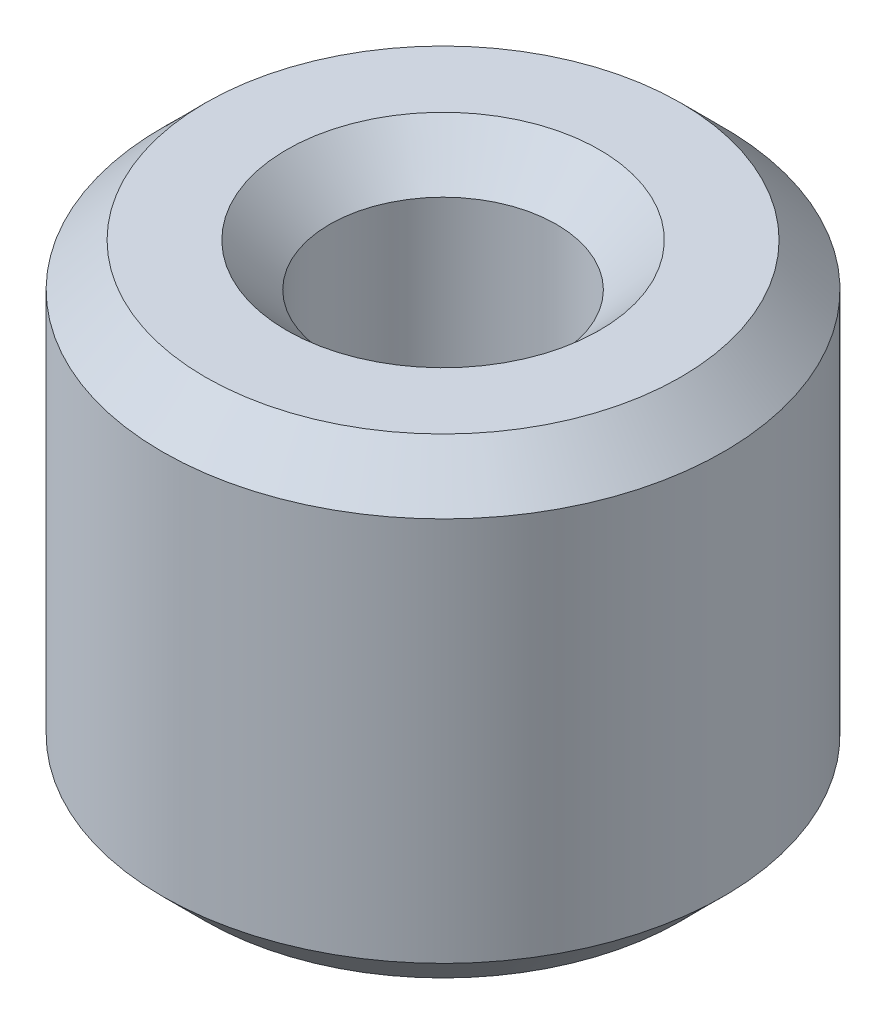
ISO-10303-21;
HEADER;
FILE_DESCRIPTION(('STEP AP214'),'2;1');
FILE_NAME('part.step','',(''),(''),'','','');
FILE_SCHEMA(('AUTOMOTIVE_DESIGN { 1 0 10303 214 1 1 1 1 }'));
ENDSEC;
DATA;
#1=APPLICATION_CONTEXT('core data for automotive mechanical design processes');
#2=APPLICATION_PROTOCOL_DEFINITION('international standard','automotive_design',2000,#1);
#3=PRODUCT_CONTEXT('',#1,'mechanical');
#4=PRODUCT('Part','Part','',(#3));
#5=PRODUCT_RELATED_PRODUCT_CATEGORY('part','',(#4));
#6=PRODUCT_DEFINITION_FORMATION('','',#4);
#7=PRODUCT_DEFINITION_CONTEXT('part definition',#1,'design');
#8=PRODUCT_DEFINITION('design','',#6,#7);
#9=PRODUCT_DEFINITION_SHAPE('','',#8);
#10=(LENGTH_UNIT() NAMED_UNIT(*) SI_UNIT(.MILLI.,.METRE.));
#11=(NAMED_UNIT(*) PLANE_ANGLE_UNIT() SI_UNIT($,.RADIAN.));
#12=(NAMED_UNIT(*) SI_UNIT($,.STERADIAN.) SOLID_ANGLE_UNIT());
#13=UNCERTAINTY_MEASURE_WITH_UNIT(LENGTH_MEASURE(1.E-05),#10,'distance_accuracy_value','');
#14=(GEOMETRIC_REPRESENTATION_CONTEXT(3) GLOBAL_UNCERTAINTY_ASSIGNED_CONTEXT((#13)) GLOBAL_UNIT_ASSIGNED_CONTEXT((#10,
#11,#12)) REPRESENTATION_CONTEXT('',''));
#15=CARTESIAN_POINT('',(0.,0.,0.));
#16=DIRECTION('',(0.,0.,1.));
#17=DIRECTION('',(1.,0.,0.));
#18=AXIS2_PLACEMENT_3D('',#15,#16,#17);
#19=CARTESIAN_POINT('',(0.,37.762597137772,0.));
#20=DIRECTION('',(0.,-1.,0.));
#21=DIRECTION('',(0.,0.,-1.));
#22=AXIS2_PLACEMENT_3D('',#19,#20,#21);
#23=CYLINDRICAL_SURFACE('',#22,22.5);
#24=CARTESIAN_POINT('',(0.,3.45340366557076,0.));
#25=DIRECTION('',(0.,1.,0.));
#26=DIRECTION('',(0.,0.,1.));
#27=AXIS2_PLACEMENT_3D('',#24,#25,#26);
#28=CIRCLE('',#27,22.5);
#29=CARTESIAN_POINT('',(0.,3.45340366557076,22.5));
#30=VERTEX_POINT('',#29);
#31=EDGE_CURVE('E10',#30,#30,#28,.T.);
#32=ORIENTED_EDGE('',*,*,#31,.T.);
#33=EDGE_LOOP('',(#32));
#34=FACE_BOUND('',#33,.T.);
#35=CARTESIAN_POINT('',(0.,34.3091934722012,0.));
#36=DIRECTION('',(0.,1.,0.));
#37=DIRECTION('',(0.,0.,1.));
#38=AXIS2_PLACEMENT_3D('',#35,#36,#37);
#39=CIRCLE('',#38,22.5);
#40=CARTESIAN_POINT('',(0.,34.3091934722012,22.5));
#41=VERTEX_POINT('',#40);
#42=EDGE_CURVE('E50',#41,#41,#39,.F.);
#43=ORIENTED_EDGE('',*,*,#42,.T.);
#44=EDGE_LOOP('',(#43));
#45=FACE_BOUND('',#44,.T.);
#46=ADVANCED_FACE('F39',(#34,#45),#23,.T.);
#47=CARTESIAN_POINT('',(0.,37.762597137772,0.));
#48=DIRECTION('',(0.,1.,0.));
#49=DIRECTION('',(0.,0.,1.));
#50=AXIS2_PLACEMENT_3D('',#47,#48,#49);
#51=PLANE('',#50);
#52=CARTESIAN_POINT('',(0.,37.762597137772,0.));
#53=DIRECTION('',(0.,1.,0.));
#54=DIRECTION('',(0.,0.,1.));
#55=AXIS2_PLACEMENT_3D('',#52,#53,#54);
#56=CIRCLE('',#55,12.5425588233075);
#57=CARTESIAN_POINT('',(0.,37.762597137772,12.5425588233075));
#58=VERTEX_POINT('',#57);
#59=EDGE_CURVE('E58',#58,#58,#56,.F.);
#60=ORIENTED_EDGE('',*,*,#59,.T.);
#61=EDGE_LOOP('',(#60));
#62=FACE_BOUND('',#61,.T.);
#63=CARTESIAN_POINT('',(0.,37.762597137772,0.));
#64=DIRECTION('',(0.,1.,0.));
#65=DIRECTION('',(0.,0.,1.));
#66=AXIS2_PLACEMENT_3D('',#63,#64,#65);
#67=CIRCLE('',#66,19.0465963344292);
#68=CARTESIAN_POINT('',(0.,37.762597137772,19.0465963344292));
#69=VERTEX_POINT('',#68);
#70=EDGE_CURVE('E61',#69,#69,#67,.T.);
#71=ORIENTED_EDGE('',*,*,#70,.T.);
#72=EDGE_LOOP('',(#71));
#73=FACE_BOUND('',#72,.T.);
#74=ADVANCED_FACE('F88',(#62,#73),#51,.T.);
#75=CARTESIAN_POINT('',(0.,0.,0.));
#76=DIRECTION('',(0.,1.,0.));
#77=DIRECTION('',(0.,0.,1.));
#78=AXIS2_PLACEMENT_3D('',#75,#76,#77);
#79=PLANE('',#78);
#80=CARTESIAN_POINT('',(0.,0.,0.));
#81=DIRECTION('',(0.,1.,0.));
#82=DIRECTION('',(0.,0.,1.));
#83=AXIS2_PLACEMENT_3D('',#80,#81,#82);
#84=CIRCLE('',#83,12.5425588233074);
#85=CARTESIAN_POINT('',(0.,0.,12.5425588233074));
#86=VERTEX_POINT('',#85);
#87=EDGE_CURVE('E51',#86,#86,#84,.T.);
#88=ORIENTED_EDGE('',*,*,#87,.T.);
#89=EDGE_LOOP('',(#88));
#90=FACE_BOUND('',#89,.T.);
#91=CARTESIAN_POINT('',(0.,0.,0.));
#92=DIRECTION('',(0.,1.,0.));
#93=DIRECTION('',(0.,0.,1.));
#94=AXIS2_PLACEMENT_3D('',#91,#92,#93);
#95=CIRCLE('',#94,19.0465963344292);
#96=CARTESIAN_POINT('',(0.,0.,19.0465963344292));
#97=VERTEX_POINT('',#96);
#98=EDGE_CURVE('E54',#97,#97,#95,.F.);
#99=ORIENTED_EDGE('',*,*,#98,.T.);
#100=EDGE_LOOP('',(#99));
#101=FACE_BOUND('',#100,.T.);
#102=ADVANCED_FACE('F83',(#90,#101),#79,.F.);
#103=CARTESIAN_POINT('',(0.,37.762597137772,0.));
#104=DIRECTION('',(0.,-1.,0.));
#105=DIRECTION('',(0.,0.,-1.));
#106=AXIS2_PLACEMENT_3D('',#103,#104,#105);
#107=CYLINDRICAL_SURFACE('',#106,9.08915515773666);
#108=CARTESIAN_POINT('',(0.,34.3091934722012,0.));
#109=DIRECTION('',(0.,1.,0.));
#110=DIRECTION('',(0.,0.,1.));
#111=AXIS2_PLACEMENT_3D('',#108,#109,#110);
#112=CIRCLE('',#111,9.08915515773666);
#113=CARTESIAN_POINT('',(0.,34.3091934722012,9.08915515773666));
#114=VERTEX_POINT('',#113);
#115=EDGE_CURVE('E67',#114,#114,#112,.T.);
#116=ORIENTED_EDGE('',*,*,#115,.T.);
#117=EDGE_LOOP('',(#116));
#118=FACE_BOUND('',#117,.T.);
#119=CARTESIAN_POINT('',(0.,3.45340366557077,0.));
#120=DIRECTION('',(0.,1.,0.));
#121=DIRECTION('',(0.,0.,1.));
#122=AXIS2_PLACEMENT_3D('',#119,#120,#121);
#123=CIRCLE('',#122,9.08915515773666);
#124=CARTESIAN_POINT('',(0.,3.45340366557077,9.08915515773666));
#125=VERTEX_POINT('',#124);
#126=EDGE_CURVE('E69',#125,#125,#123,.F.);
#127=ORIENTED_EDGE('',*,*,#126,.T.);
#128=EDGE_LOOP('',(#127));
#129=FACE_BOUND('',#128,.T.);
#130=ADVANCED_FACE('F71',(#118,#129),#107,.F.);
#131=CARTESIAN_POINT('',(0.,34.3091934722012,0.));
#132=DIRECTION('',(0.,1.,0.));
#133=DIRECTION('',(0.,0.,1.));
#134=AXIS2_PLACEMENT_3D('',#131,#132,#133);
#135=CONICAL_SURFACE('',#134,9.08915515773666,0.785398163397452);
#136=ORIENTED_EDGE('',*,*,#59,.F.);
#137=EDGE_LOOP('',(#136));
#138=FACE_BOUND('',#137,.T.);
#139=ORIENTED_EDGE('',*,*,#115,.F.);
#140=EDGE_LOOP('',(#139));
#141=FACE_BOUND('',#140,.T.);
#142=ADVANCED_FACE('F77',(#138,#141),#135,.F.);
#143=CARTESIAN_POINT('',(0.,0.,0.));
#144=DIRECTION('',(0.,-1.,0.));
#145=DIRECTION('',(0.,0.,-1.));
#146=AXIS2_PLACEMENT_3D('',#143,#144,#145);
#147=CONICAL_SURFACE('',#146,12.5425588233074,0.785398163397446);
#148=ORIENTED_EDGE('',*,*,#126,.F.);
#149=EDGE_LOOP('',(#148));
#150=FACE_BOUND('',#149,.T.);
#151=ORIENTED_EDGE('',*,*,#87,.F.);
#152=EDGE_LOOP('',(#151));
#153=FACE_BOUND('',#152,.T.);
#154=ADVANCED_FACE('F73',(#150,#153),#147,.F.);
#155=CARTESIAN_POINT('',(0.,3.45340366557076,0.));
#156=DIRECTION('',(0.,1.,0.));
#157=DIRECTION('',(0.,0.,1.));
#158=AXIS2_PLACEMENT_3D('',#155,#156,#157);
#159=CONICAL_SURFACE('',#158,22.5,0.785398163397452);
#160=CARTESIAN_POINT('',(0.,0.,19.0465963344292));
#161=CARTESIAN_POINT('',(0.,0.035972954849695,19.0825692892789));
#162=CARTESIAN_POINT('',(0.,0.0719459096993904,19.1185422441286));
#163=CARTESIAN_POINT('',(0.,0.143891819398781,19.190488153828));
#164=CARTESIAN_POINT('',(0.,0.179864774248477,19.2264611086777));
#165=CARTESIAN_POINT('',(0.,0.251810683947867,19.2984070183771));
#166=CARTESIAN_POINT('',(0.,0.287783638797563,19.3343799732268));
#167=CARTESIAN_POINT('',(0.,0.359729548496954,19.4063258829262));
#168=CARTESIAN_POINT('',(0.,0.395702503346649,19.4422988377759));
#169=CARTESIAN_POINT('',(0.,0.46764841304604,19.5142447474753));
#170=CARTESIAN_POINT('',(0.,0.503621367895735,19.550217702325));
#171=CARTESIAN_POINT('',(0.,0.575567277595126,19.6221636120243));
#172=CARTESIAN_POINT('',(0.,0.611540232444821,19.658136566874));
#173=CARTESIAN_POINT('',(0.,0.683486142144212,19.7300824765734));
#174=CARTESIAN_POINT('',(0.,0.719459096993908,19.7660554314231));
#175=CARTESIAN_POINT('',(0.,0.791405006693298,19.8380013411225));
#176=CARTESIAN_POINT('',(0.,0.827377961542994,19.8739742959722));
#177=CARTESIAN_POINT('',(0.,0.899323871242385,19.9459202056716));
#178=CARTESIAN_POINT('',(0.,0.93529682609208,19.9818931605213));
#179=CARTESIAN_POINT('',(0.,1.00724273579147,20.0538390702207));
#180=CARTESIAN_POINT('',(0.,1.04321569064117,20.0898120250704));
#181=CARTESIAN_POINT('',(0.,1.11516160034056,20.1617579347698));
#182=CARTESIAN_POINT('',(0.,1.15113455519025,20.1977308896195));
#183=CARTESIAN_POINT('',(0.,1.22308046488964,20.2696767993189));
#184=CARTESIAN_POINT('',(0.,1.25905341973934,20.3056497541686));
#185=CARTESIAN_POINT('',(0.,1.33099932943873,20.377595663868));
#186=CARTESIAN_POINT('',(0.,1.36697228428842,20.4135686187177));
#187=CARTESIAN_POINT('',(0.,1.43891819398782,20.485514528417));
#188=CARTESIAN_POINT('',(0.,1.47489114883751,20.5214874832667));
#189=CARTESIAN_POINT('',(0.,1.5468370585369,20.5934333929661));
#190=CARTESIAN_POINT('',(0.,1.5828100133866,20.6294063478158));
#191=CARTESIAN_POINT('',(0.,1.65475592308599,20.7013522575152));
#192=CARTESIAN_POINT('',(0.,1.69072887793568,20.7373252123649));
#193=CARTESIAN_POINT('',(0.,1.76267478763507,20.8092711220643));
#194=CARTESIAN_POINT('',(0.,1.79864774248477,20.845244076914));
#195=CARTESIAN_POINT('',(0.,1.87059365218416,20.9171899866134));
#196=CARTESIAN_POINT('',(0.,1.90656660703386,20.9531629414631));
#197=CARTESIAN_POINT('',(0.,1.97851251673325,21.0251088511625));
#198=CARTESIAN_POINT('',(0.,2.01448547158294,21.0610818060122));
#199=CARTESIAN_POINT('',(0.,2.08643138128233,21.1330277157116));
#200=CARTESIAN_POINT('',(0.,2.12240433613203,21.1690006705613));
#201=CARTESIAN_POINT('',(0.,2.19435024583142,21.2409465802607));
#202=CARTESIAN_POINT('',(0.,2.23032320068112,21.2769195351104));
#203=CARTESIAN_POINT('',(0.,2.30226911038051,21.3488654448097));
#204=CARTESIAN_POINT('',(0.,2.3382420652302,21.3848383996594));
#205=CARTESIAN_POINT('',(0.,2.41018797492959,21.4567843093588));
#206=CARTESIAN_POINT('',(0.,2.44616092977929,21.4927572642085));
#207=CARTESIAN_POINT('',(0.,2.51810683947868,21.5647031739079));
#208=CARTESIAN_POINT('',(0.,2.55407979432837,21.6006761287576));
#209=CARTESIAN_POINT('',(0.,2.62602570402776,21.672622038457));
#210=CARTESIAN_POINT('',(0.,2.66199865887746,21.7085949933067));
#211=CARTESIAN_POINT('',(0.,2.73394456857685,21.7805409030061));
#212=CARTESIAN_POINT('',(0.,2.76991752342655,21.8165138578558));
#213=CARTESIAN_POINT('',(0.,2.84186343312594,21.8884597675552));
#214=CARTESIAN_POINT('',(0.,2.87783638797563,21.9244327224049));
#215=CARTESIAN_POINT('',(0.,2.94978229767502,21.9963786321043));
#216=CARTESIAN_POINT('',(0.,2.98575525252472,22.032351586954));
#217=CARTESIAN_POINT('',(0.,3.05770116222411,22.1042974966533));
#218=CARTESIAN_POINT('',(0.,3.0936741170738,22.140270451503));
#219=CARTESIAN_POINT('',(0.,3.1656200267732,22.2122163612024));
#220=CARTESIAN_POINT('',(0.,3.20159298162289,22.2481893160521));
#221=CARTESIAN_POINT('',(0.,3.27353889132228,22.3201352257515));
#222=CARTESIAN_POINT('',(0.,3.30951184617198,22.3561081806012));
#223=CARTESIAN_POINT('',(0.,3.38145775587137,22.4280540903006));
#224=CARTESIAN_POINT('',(0.,3.41743071072106,22.4640270451503));
#225=CARTESIAN_POINT('',(0.,3.45340366557076,22.5));
#226=B_SPLINE_CURVE_WITH_KNOTS('',3,(#160,#161,#162,#163,#164,#165,#166,#167,#168,#169,#170,
#171,#172,#173,#174,#175,#176,#177,#178,#179,#180,#181,#182,#183,#184,#185,#186,#187,#188,#189,
#190,#191,#192,#193,#194,#195,#196,#197,#198,#199,#200,#201,#202,#203,#204,#205,#206,#207,#208,
#209,#210,#211,#212,#213,#214,#215,#216,#217,#218,#219,#220,#221,#222,#223,#224,#225),
.UNSPECIFIED.,.F.,.F.,(4,2,2,2,2,2,2,2,2,2,2,2,2,2,2,2,2,2,2,2,2,2,2,2,2,2,2,2,2,2,2,2,4),(0.,
0.152620321881223,0.305240643762447,0.45786096564367,0.610481287524893,0.763101609406117,
0.91572193128734,1.06834225316856,1.22096257504979,1.37358289693101,1.52620321881223,
1.67882354069346,1.83144386257468,1.9840641844559,2.13668450633713,2.28930482821835,
2.44192515009957,2.5945454719808,2.74716579386202,2.89978611574324,3.05240643762447,
3.20502675950569,3.35764708138691,3.51026740326814,3.66288772514936,3.81550804703058,
3.96812836891181,4.12074869079303,4.27336901267425,4.42598933455548,4.5786096564367,
4.73122997831792,4.88385030019915),.UNSPECIFIED.);
#227=EDGE_CURVE('BSEAM76',#97,#30,#226,.T.);
#228=ORIENTED_EDGE('',*,*,#98,.F.);
#229=ORIENTED_EDGE('',*,*,#31,.F.);
#230=ORIENTED_EDGE('',*,*,#227,.T.);
#231=ORIENTED_EDGE('',*,*,#227,.F.);
#232=EDGE_LOOP('',(#228,#230,#229,#231));
#233=FACE_BOUND('',#232,.T.);
#234=ADVANCED_FACE('F76',(#233),#159,.T.);
#235=CARTESIAN_POINT('',(0.,37.762597137772,0.));
#236=DIRECTION('',(0.,-1.,0.));
#237=DIRECTION('',(0.,0.,-1.));
#238=AXIS2_PLACEMENT_3D('',#235,#236,#237);
#239=CONICAL_SURFACE('',#238,19.0465963344292,0.785398163397446);
#240=ORIENTED_EDGE('',*,*,#42,.F.);
#241=EDGE_LOOP('',(#240));
#242=FACE_BOUND('',#241,.T.);
#243=ORIENTED_EDGE('',*,*,#70,.F.);
#244=EDGE_LOOP('',(#243));
#245=FACE_BOUND('',#244,.T.);
#246=ADVANCED_FACE('F45',(#242,#245),#239,.T.);
#247=CLOSED_SHELL('',(#46,#74,#102,#130,#142,#154,#234,#246));
#248=MANIFOLD_SOLID_BREP('B2',#247);
#249=ADVANCED_BREP_SHAPE_REPRESENTATION('',(#18,#248),#14);
#250=SHAPE_DEFINITION_REPRESENTATION(#9,#249);
ENDSEC;
END-ISO-10303-21;
